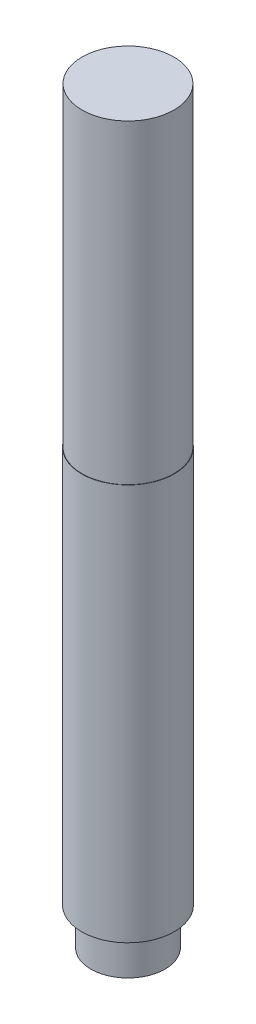
ISO-10303-21;
HEADER;
FILE_DESCRIPTION(('STEP AP214'),'2;1');
FILE_NAME('part.step','',(''),(''),'','','');
FILE_SCHEMA(('AUTOMOTIVE_DESIGN { 1 0 10303 214 1 1 1 1 }'));
ENDSEC;
DATA;
#1=APPLICATION_CONTEXT('core data for automotive mechanical design processes');
#2=APPLICATION_PROTOCOL_DEFINITION('international standard','automotive_design',2000,#1);
#3=PRODUCT_CONTEXT('',#1,'mechanical');
#4=PRODUCT('Part','Part','',(#3));
#5=PRODUCT_RELATED_PRODUCT_CATEGORY('part','',(#4));
#6=PRODUCT_DEFINITION_FORMATION('','',#4);
#7=PRODUCT_DEFINITION_CONTEXT('part definition',#1,'design');
#8=PRODUCT_DEFINITION('design','',#6,#7);
#9=PRODUCT_DEFINITION_SHAPE('','',#8);
#10=(LENGTH_UNIT() NAMED_UNIT(*) SI_UNIT(.MILLI.,.METRE.));
#11=(NAMED_UNIT(*) PLANE_ANGLE_UNIT() SI_UNIT($,.RADIAN.));
#12=(NAMED_UNIT(*) SI_UNIT($,.STERADIAN.) SOLID_ANGLE_UNIT());
#13=UNCERTAINTY_MEASURE_WITH_UNIT(LENGTH_MEASURE(1.E-05),#10,'distance_accuracy_value','');
#14=(GEOMETRIC_REPRESENTATION_CONTEXT(3) GLOBAL_UNCERTAINTY_ASSIGNED_CONTEXT((#13)) GLOBAL_UNIT_ASSIGNED_CONTEXT((#10,
#11,#12)) REPRESENTATION_CONTEXT('',''));
#15=CARTESIAN_POINT('',(0.,0.,0.));
#16=DIRECTION('',(0.,0.,1.));
#17=DIRECTION('',(1.,0.,0.));
#18=AXIS2_PLACEMENT_3D('',#15,#16,#17);
#19=CARTESIAN_POINT('',(0.,107.,0.));
#20=DIRECTION('',(0.,-1.,0.));
#21=DIRECTION('',(0.,0.,-1.));
#22=AXIS2_PLACEMENT_3D('',#19,#20,#21);
#23=CYLINDRICAL_SURFACE('',#22,12.5);
#24=CARTESIAN_POINT('',(0.,107.,0.));
#25=DIRECTION('',(0.,1.,0.));
#26=DIRECTION('',(0.,0.,1.));
#27=AXIS2_PLACEMENT_3D('',#24,#25,#26);
#28=CIRCLE('',#27,12.5);
#29=CARTESIAN_POINT('',(0.,107.,12.5));
#30=VERTEX_POINT('',#29);
#31=EDGE_CURVE('E37',#30,#30,#28,.T.);
#32=ORIENTED_EDGE('',*,*,#31,.F.);
#33=EDGE_LOOP('',(#32));
#34=FACE_BOUND('',#33,.T.);
#35=CARTESIAN_POINT('',(0.,0.,0.));
#36=DIRECTION('',(0.,1.,0.));
#37=DIRECTION('',(0.,0.,1.));
#38=AXIS2_PLACEMENT_3D('',#35,#36,#37);
#39=CIRCLE('',#38,12.5);
#40=CARTESIAN_POINT('',(0.,0.,12.5));
#41=VERTEX_POINT('',#40);
#42=EDGE_CURVE('E41',#41,#41,#39,.T.);
#43=ORIENTED_EDGE('',*,*,#42,.T.);
#44=EDGE_LOOP('',(#43));
#45=FACE_BOUND('',#44,.T.);
#46=ADVANCED_FACE('F31',(#34,#45),#23,.T.);
#47=CARTESIAN_POINT('',(0.,107.,0.));
#48=DIRECTION('',(0.,1.,0.));
#49=DIRECTION('',(0.,0.,1.));
#50=AXIS2_PLACEMENT_3D('',#47,#48,#49);
#51=PLANE('',#50);
#52=CARTESIAN_POINT('',(0.,107.,0.));
#53=DIRECTION('',(0.,1.,0.));
#54=DIRECTION('',(0.,0.,1.));
#55=AXIS2_PLACEMENT_3D('',#52,#53,#54);
#56=CIRCLE('',#55,12.4);
#57=CARTESIAN_POINT('',(0.,107.,12.4));
#58=VERTEX_POINT('',#57);
#59=EDGE_CURVE('E48',#58,#58,#56,.T.);
#60=ORIENTED_EDGE('',*,*,#59,.F.);
#61=EDGE_LOOP('',(#60));
#62=FACE_BOUND('',#61,.T.);
#63=ORIENTED_EDGE('',*,*,#31,.T.);
#64=EDGE_LOOP('',(#63));
#65=FACE_BOUND('',#64,.T.);
#66=ADVANCED_FACE('F72',(#62,#65),#51,.T.);
#67=CARTESIAN_POINT('',(0.,0.,0.));
#68=DIRECTION('',(0.,1.,0.));
#69=DIRECTION('',(0.,0.,1.));
#70=AXIS2_PLACEMENT_3D('',#67,#68,#69);
#71=PLANE('',#70);
#72=CARTESIAN_POINT('',(0.,0.,0.));
#73=DIRECTION('',(0.,1.,0.));
#74=DIRECTION('',(0.,0.,1.));
#75=AXIS2_PLACEMENT_3D('',#72,#73,#74);
#76=CIRCLE('',#75,10.);
#77=CARTESIAN_POINT('',(0.,0.,10.));
#78=VERTEX_POINT('',#77);
#79=EDGE_CURVE('E10',#78,#78,#76,.F.);
#80=ORIENTED_EDGE('',*,*,#79,.F.);
#81=EDGE_LOOP('',(#80));
#82=FACE_BOUND('',#81,.T.);
#83=ORIENTED_EDGE('',*,*,#42,.F.);
#84=EDGE_LOOP('',(#83));
#85=FACE_BOUND('',#84,.T.);
#86=ADVANCED_FACE('F77',(#82,#85),#71,.F.);
#87=CARTESIAN_POINT('',(0.,192.,0.));
#88=DIRECTION('',(0.,-1.,0.));
#89=DIRECTION('',(0.,0.,-1.));
#90=AXIS2_PLACEMENT_3D('',#87,#88,#89);
#91=CYLINDRICAL_SURFACE('',#90,12.4);
#92=CARTESIAN_POINT('',(0.,192.,0.));
#93=DIRECTION('',(0.,1.,0.));
#94=DIRECTION('',(0.,0.,1.));
#95=AXIS2_PLACEMENT_3D('',#92,#93,#94);
#96=CIRCLE('',#95,12.4);
#97=CARTESIAN_POINT('',(0.,192.,12.4));
#98=VERTEX_POINT('',#97);
#99=EDGE_CURVE('E46',#98,#98,#96,.T.);
#100=ORIENTED_EDGE('',*,*,#99,.F.);
#101=EDGE_LOOP('',(#100));
#102=FACE_BOUND('',#101,.T.);
#103=ORIENTED_EDGE('',*,*,#59,.T.);
#104=EDGE_LOOP('',(#103));
#105=FACE_BOUND('',#104,.T.);
#106=ADVANCED_FACE('F68',(#102,#105),#91,.T.);
#107=CARTESIAN_POINT('',(0.,192.,0.));
#108=DIRECTION('',(0.,1.,0.));
#109=DIRECTION('',(0.,0.,1.));
#110=AXIS2_PLACEMENT_3D('',#107,#108,#109);
#111=PLANE('',#110);
#112=ORIENTED_EDGE('',*,*,#99,.T.);
#113=EDGE_LOOP('',(#112));
#114=FACE_BOUND('',#113,.T.);
#115=ADVANCED_FACE('F61',(#114),#111,.T.);
#116=CARTESIAN_POINT('',(0.,-10.,0.));
#117=DIRECTION('',(0.,1.,0.));
#118=DIRECTION('',(0.,0.,1.));
#119=AXIS2_PLACEMENT_3D('',#116,#117,#118);
#120=CYLINDRICAL_SURFACE('',#119,10.);
#121=CARTESIAN_POINT('',(0.,-10.,0.));
#122=DIRECTION('',(0.,-1.,0.));
#123=DIRECTION('',(0.,0.,-1.));
#124=AXIS2_PLACEMENT_3D('',#121,#122,#123);
#125=CIRCLE('',#124,10.);
#126=CARTESIAN_POINT('',(0.,-10.,-10.));
#127=VERTEX_POINT('',#126);
#128=EDGE_CURVE('E51',#127,#127,#125,.T.);
#129=ORIENTED_EDGE('',*,*,#128,.F.);
#130=EDGE_LOOP('',(#129));
#131=FACE_BOUND('',#130,.T.);
#132=ORIENTED_EDGE('',*,*,#79,.T.);
#133=EDGE_LOOP('',(#132));
#134=FACE_BOUND('',#133,.T.);
#135=ADVANCED_FACE('F59',(#131,#134),#120,.T.);
#136=CARTESIAN_POINT('',(0.,-10.,0.));
#137=DIRECTION('',(0.,-1.,0.));
#138=DIRECTION('',(0.,0.,-1.));
#139=AXIS2_PLACEMENT_3D('',#136,#137,#138);
#140=PLANE('',#139);
#141=ORIENTED_EDGE('',*,*,#128,.T.);
#142=EDGE_LOOP('',(#141));
#143=FACE_BOUND('',#142,.T.);
#144=ADVANCED_FACE('F57',(#143),#140,.T.);
#145=CLOSED_SHELL('',(#46,#66,#86,#106,#115,#135,#144));
#146=MANIFOLD_SOLID_BREP('B2',#145);
#147=ADVANCED_BREP_SHAPE_REPRESENTATION('',(#18,#146),#14);
#148=SHAPE_DEFINITION_REPRESENTATION(#9,#147);
ENDSEC;
END-ISO-10303-21;
